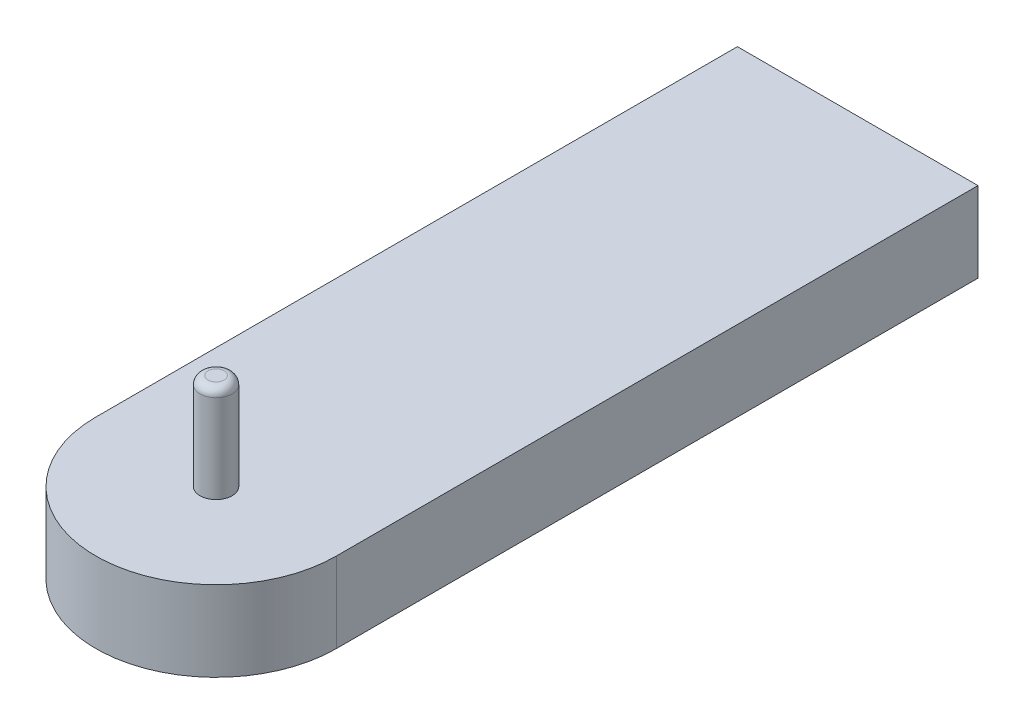
ISO-10303-21;
HEADER;
FILE_DESCRIPTION(('STEP AP214'),'2;1');
FILE_NAME('part.step','',(''),(''),'','','');
FILE_SCHEMA(('AUTOMOTIVE_DESIGN { 1 0 10303 214 1 1 1 1 }'));
ENDSEC;
DATA;
#1=APPLICATION_CONTEXT('core data for automotive mechanical design processes');
#2=APPLICATION_PROTOCOL_DEFINITION('international standard','automotive_design',2000,#1);
#3=PRODUCT_CONTEXT('',#1,'mechanical');
#4=PRODUCT('Part','Part','',(#3));
#5=PRODUCT_RELATED_PRODUCT_CATEGORY('part','',(#4));
#6=PRODUCT_DEFINITION_FORMATION('','',#4);
#7=PRODUCT_DEFINITION_CONTEXT('part definition',#1,'design');
#8=PRODUCT_DEFINITION('design','',#6,#7);
#9=PRODUCT_DEFINITION_SHAPE('','',#8);
#10=(LENGTH_UNIT() NAMED_UNIT(*) SI_UNIT(.MILLI.,.METRE.));
#11=(NAMED_UNIT(*) PLANE_ANGLE_UNIT() SI_UNIT($,.RADIAN.));
#12=(NAMED_UNIT(*) SI_UNIT($,.STERADIAN.) SOLID_ANGLE_UNIT());
#13=UNCERTAINTY_MEASURE_WITH_UNIT(LENGTH_MEASURE(1.E-05),#10,'distance_accuracy_value','');
#14=(GEOMETRIC_REPRESENTATION_CONTEXT(3) GLOBAL_UNCERTAINTY_ASSIGNED_CONTEXT((#13)) GLOBAL_UNIT_ASSIGNED_CONTEXT((#10,
#11,#12)) REPRESENTATION_CONTEXT('',''));
#15=CARTESIAN_POINT('',(0.,0.,0.));
#16=DIRECTION('',(0.,0.,1.));
#17=DIRECTION('',(1.,0.,0.));
#18=AXIS2_PLACEMENT_3D('',#15,#16,#17);
#19=CARTESIAN_POINT('',(75.0000000000001,50.,400.));
#20=DIRECTION('',(0.,1.,0.));
#21=DIRECTION('',(0.,0.,1.));
#22=AXIS2_PLACEMENT_3D('',#19,#20,#21);
#23=PLANE('',#22);
#24=DIRECTION('',(0.,0.,1.));
#25=VECTOR('',#24,1.);
#26=CARTESIAN_POINT('',(0.,50.,0.));
#27=LINE('',#26,#25);
#28=CARTESIAN_POINT('',(0.,50.,0.));
#29=VERTEX_POINT('',#28);
#30=CARTESIAN_POINT('',(0.,50.,400.));
#31=VERTEX_POINT('',#30);
#32=EDGE_CURVE('E90',#29,#31,#27,.T.);
#33=ORIENTED_EDGE('',*,*,#32,.T.);
#34=CARTESIAN_POINT('',(75.0000000000001,50.,400.));
#35=DIRECTION('',(0.,1.,0.));
#36=DIRECTION('',(0.,0.,1.));
#37=AXIS2_PLACEMENT_3D('',#34,#35,#36);
#38=CIRCLE('',#37,75.);
#39=CARTESIAN_POINT('',(150.,50.,400.));
#40=VERTEX_POINT('',#39);
#41=EDGE_CURVE('E85',#31,#40,#38,.T.);
#42=ORIENTED_EDGE('',*,*,#41,.T.);
#43=DIRECTION('',(0.,0.,-1.));
#44=VECTOR('',#43,1.);
#45=CARTESIAN_POINT('',(150.,50.,0.));
#46=LINE('',#45,#44);
#47=CARTESIAN_POINT('',(150.,50.,0.));
#48=VERTEX_POINT('',#47);
#49=EDGE_CURVE('E88',#40,#48,#46,.T.);
#50=ORIENTED_EDGE('',*,*,#49,.T.);
#51=DIRECTION('',(-1.,0.,0.));
#52=VECTOR('',#51,1.);
#53=CARTESIAN_POINT('',(0.,50.,0.));
#54=LINE('',#53,#52);
#55=EDGE_CURVE('E54',#48,#29,#54,.T.);
#56=ORIENTED_EDGE('',*,*,#55,.T.);
#57=EDGE_LOOP('',(#33,#42,#50,#56));
#58=FACE_BOUND('',#57,.T.);
#59=CARTESIAN_POINT('',(75.0000000000001,50.,400.));
#60=DIRECTION('',(0.,1.,0.));
#61=DIRECTION('',(0.,0.,1.));
#62=AXIS2_PLACEMENT_3D('',#59,#60,#61);
#63=CIRCLE('',#62,10.);
#64=CARTESIAN_POINT('',(75.0000000000001,50.,410.));
#65=VERTEX_POINT('',#64);
#66=EDGE_CURVE('E108',#65,#65,#63,.T.);
#67=ORIENTED_EDGE('',*,*,#66,.F.);
#68=EDGE_LOOP('',(#67));
#69=FACE_BOUND('',#68,.T.);
#70=ADVANCED_FACE('F37',(#58,#69),#23,.T.);
#71=CARTESIAN_POINT('',(0.,50.,0.));
#72=DIRECTION('',(1.,0.,0.));
#73=DIRECTION('',(0.,0.,-1.));
#74=AXIS2_PLACEMENT_3D('',#71,#72,#73);
#75=PLANE('',#74);
#76=DIRECTION('',(0.,0.,1.));
#77=VECTOR('',#76,1.);
#78=CARTESIAN_POINT('',(0.,0.,0.));
#79=LINE('',#78,#77);
#80=CARTESIAN_POINT('',(0.,0.,0.));
#81=VERTEX_POINT('',#80);
#82=CARTESIAN_POINT('',(0.,0.,400.));
#83=VERTEX_POINT('',#82);
#84=EDGE_CURVE('E105',#81,#83,#79,.T.);
#85=ORIENTED_EDGE('',*,*,#84,.T.);
#86=DIRECTION('',(0.,-1.,0.));
#87=VECTOR('',#86,1.);
#88=CARTESIAN_POINT('',(0.,50.,400.));
#89=LINE('',#88,#87);
#90=EDGE_CURVE('E96',#31,#83,#89,.T.);
#91=ORIENTED_EDGE('',*,*,#90,.F.);
#92=ORIENTED_EDGE('',*,*,#32,.F.);
#93=DIRECTION('',(0.,-1.,0.));
#94=VECTOR('',#93,1.);
#95=CARTESIAN_POINT('',(0.,50.,0.));
#96=LINE('',#95,#94);
#97=EDGE_CURVE('E101',#29,#81,#96,.T.);
#98=ORIENTED_EDGE('',*,*,#97,.T.);
#99=EDGE_LOOP('',(#85,#91,#92,#98));
#100=FACE_BOUND('',#99,.T.);
#101=ADVANCED_FACE('F128',(#100),#75,.F.);
#102=CARTESIAN_POINT('',(75.0000000000001,50.,400.));
#103=DIRECTION('',(0.,-1.,0.));
#104=DIRECTION('',(0.,0.,-1.));
#105=AXIS2_PLACEMENT_3D('',#102,#103,#104);
#106=CYLINDRICAL_SURFACE('',#105,75.);
#107=CARTESIAN_POINT('',(75.0000000000001,0.,400.));
#108=DIRECTION('',(0.,1.,0.));
#109=DIRECTION('',(0.,0.,1.));
#110=AXIS2_PLACEMENT_3D('',#107,#108,#109);
#111=CIRCLE('',#110,75.);
#112=CARTESIAN_POINT('',(150.,0.,400.));
#113=VERTEX_POINT('',#112);
#114=EDGE_CURVE('E95',#83,#113,#111,.T.);
#115=ORIENTED_EDGE('',*,*,#114,.T.);
#116=DIRECTION('',(0.,-1.,0.));
#117=VECTOR('',#116,1.);
#118=CARTESIAN_POINT('',(150.,50.,400.));
#119=LINE('',#118,#117);
#120=EDGE_CURVE('E93',#40,#113,#119,.T.);
#121=ORIENTED_EDGE('',*,*,#120,.F.);
#122=ORIENTED_EDGE('',*,*,#41,.F.);
#123=ORIENTED_EDGE('',*,*,#90,.T.);
#124=EDGE_LOOP('',(#115,#121,#122,#123));
#125=FACE_BOUND('',#124,.T.);
#126=ADVANCED_FACE('F94',(#125),#106,.T.);
#127=CARTESIAN_POINT('',(150.,50.,0.));
#128=DIRECTION('',(-1.,0.,0.));
#129=DIRECTION('',(0.,0.,1.));
#130=AXIS2_PLACEMENT_3D('',#127,#128,#129);
#131=PLANE('',#130);
#132=DIRECTION('',(0.,0.,-1.));
#133=VECTOR('',#132,1.);
#134=CARTESIAN_POINT('',(150.,0.,0.));
#135=LINE('',#134,#133);
#136=CARTESIAN_POINT('',(150.,0.,0.));
#137=VERTEX_POINT('',#136);
#138=EDGE_CURVE('E71',#113,#137,#135,.T.);
#139=ORIENTED_EDGE('',*,*,#138,.T.);
#140=DIRECTION('',(0.,-1.,0.));
#141=VECTOR('',#140,1.);
#142=CARTESIAN_POINT('',(150.,50.,0.));
#143=LINE('',#142,#141);
#144=EDGE_CURVE('E97',#48,#137,#143,.T.);
#145=ORIENTED_EDGE('',*,*,#144,.F.);
#146=ORIENTED_EDGE('',*,*,#49,.F.);
#147=ORIENTED_EDGE('',*,*,#120,.T.);
#148=EDGE_LOOP('',(#139,#145,#146,#147));
#149=FACE_BOUND('',#148,.T.);
#150=ADVANCED_FACE('F99',(#149),#131,.F.);
#151=CARTESIAN_POINT('',(0.,50.,0.));
#152=DIRECTION('',(0.,0.,1.));
#153=DIRECTION('',(1.,0.,0.));
#154=AXIS2_PLACEMENT_3D('',#151,#152,#153);
#155=PLANE('',#154);
#156=DIRECTION('',(-1.,0.,0.));
#157=VECTOR('',#156,1.);
#158=CARTESIAN_POINT('',(0.,0.,0.));
#159=LINE('',#158,#157);
#160=EDGE_CURVE('E77',#137,#81,#159,.T.);
#161=ORIENTED_EDGE('',*,*,#160,.T.);
#162=ORIENTED_EDGE('',*,*,#97,.F.);
#163=ORIENTED_EDGE('',*,*,#55,.F.);
#164=ORIENTED_EDGE('',*,*,#144,.T.);
#165=EDGE_LOOP('',(#161,#162,#163,#164));
#166=FACE_BOUND('',#165,.T.);
#167=ADVANCED_FACE('F139',(#166),#155,.F.);
#168=CARTESIAN_POINT('',(75.0000000000001,0.,400.));
#169=DIRECTION('',(0.,1.,0.));
#170=DIRECTION('',(0.,0.,1.));
#171=AXIS2_PLACEMENT_3D('',#168,#169,#170);
#172=PLANE('',#171);
#173=ORIENTED_EDGE('',*,*,#84,.F.);
#174=ORIENTED_EDGE('',*,*,#160,.F.);
#175=ORIENTED_EDGE('',*,*,#138,.F.);
#176=ORIENTED_EDGE('',*,*,#114,.F.);
#177=EDGE_LOOP('',(#173,#174,#175,#176));
#178=FACE_BOUND('',#177,.T.);
#179=ADVANCED_FACE('F136',(#178),#172,.F.);
#180=CARTESIAN_POINT('',(75.0000000000001,110.,400.));
#181=DIRECTION('',(0.,-1.,0.));
#182=DIRECTION('',(0.,0.,-1.));
#183=AXIS2_PLACEMENT_3D('',#180,#181,#182);
#184=CYLINDRICAL_SURFACE('',#183,10.);
#185=CARTESIAN_POINT('',(75.0000000000001,105.,400.));
#186=DIRECTION('',(0.,1.,0.));
#187=DIRECTION('',(0.,0.,1.));
#188=AXIS2_PLACEMENT_3D('',#185,#186,#187);
#189=CIRCLE('',#188,10.);
#190=CARTESIAN_POINT('',(75.0000000000001,105.,410.));
#191=VERTEX_POINT('',#190);
#192=EDGE_CURVE('E11',#191,#191,#189,.F.);
#193=ORIENTED_EDGE('',*,*,#192,.T.);
#194=EDGE_LOOP('',(#193));
#195=FACE_BOUND('',#194,.T.);
#196=ORIENTED_EDGE('',*,*,#66,.T.);
#197=EDGE_LOOP('',(#196));
#198=FACE_BOUND('',#197,.T.);
#199=ADVANCED_FACE('F124',(#195,#198),#184,.T.);
#200=CARTESIAN_POINT('',(75.0000000000001,110.,400.));
#201=DIRECTION('',(0.,1.,0.));
#202=DIRECTION('',(0.,0.,1.));
#203=AXIS2_PLACEMENT_3D('',#200,#201,#202);
#204=PLANE('',#203);
#205=CARTESIAN_POINT('',(75.0000000000001,110.,400.));
#206=DIRECTION('',(0.,1.,0.));
#207=DIRECTION('',(0.,0.,1.));
#208=AXIS2_PLACEMENT_3D('',#205,#206,#207);
#209=CIRCLE('',#208,5.);
#210=CARTESIAN_POINT('',(75.0000000000001,110.,405.));
#211=VERTEX_POINT('',#210);
#212=EDGE_CURVE('E46',#211,#211,#209,.T.);
#213=ORIENTED_EDGE('',*,*,#212,.T.);
#214=EDGE_LOOP('',(#213));
#215=FACE_BOUND('',#214,.T.);
#216=ADVANCED_FACE('F117',(#215),#204,.T.);
#217=CARTESIAN_POINT('',(75.0000000000001,105.,400.));
#218=DIRECTION('',(0.,1.,0.));
#219=DIRECTION('',(0.,0.,1.));
#220=AXIS2_PLACEMENT_3D('',#217,#218,#219);
#221=DEGENERATE_TOROIDAL_SURFACE('',#220,5.,5.,.T.);
#222=ORIENTED_EDGE('',*,*,#192,.F.);
#223=EDGE_LOOP('',(#222));
#224=FACE_BOUND('',#223,.T.);
#225=ORIENTED_EDGE('',*,*,#212,.F.);
#226=EDGE_LOOP('',(#225));
#227=FACE_BOUND('',#226,.T.);
#228=ADVANCED_FACE('F39',(#224,#227),#221,.T.);
#229=CLOSED_SHELL('',(#70,#101,#126,#150,#167,#179,#199,#216,#228));
#230=MANIFOLD_SOLID_BREP('B2',#229);
#231=ADVANCED_BREP_SHAPE_REPRESENTATION('',(#18,#230),#14);
#232=SHAPE_DEFINITION_REPRESENTATION(#9,#231);
ENDSEC;
END-ISO-10303-21;
